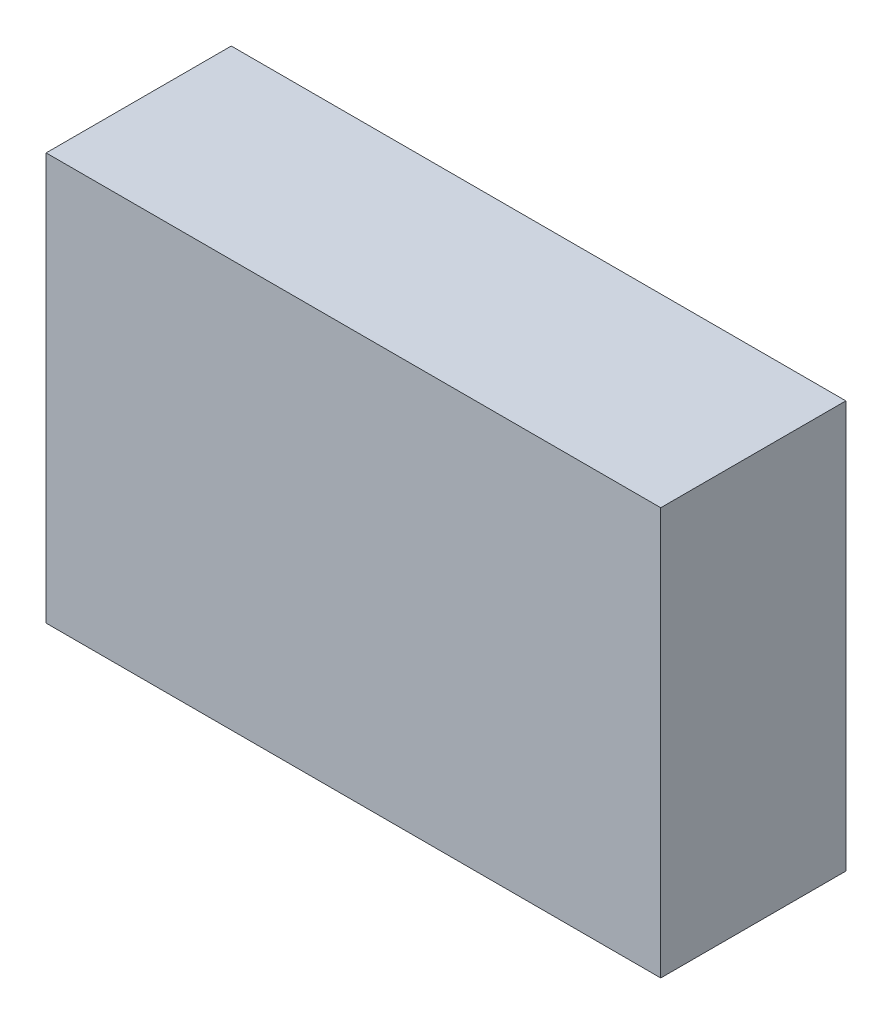
ISO-10303-21;
HEADER;
FILE_DESCRIPTION(('STEP AP214'),'2;1');
FILE_NAME('part.step','',(''),(''),'','','');
FILE_SCHEMA(('AUTOMOTIVE_DESIGN { 1 0 10303 214 1 1 1 1 }'));
ENDSEC;
DATA;
#1=APPLICATION_CONTEXT('core data for automotive mechanical design processes');
#2=APPLICATION_PROTOCOL_DEFINITION('international standard','automotive_design',2000,#1);
#3=PRODUCT_CONTEXT('',#1,'mechanical');
#4=PRODUCT('Part','Part','',(#3));
#5=PRODUCT_RELATED_PRODUCT_CATEGORY('part','',(#4));
#6=PRODUCT_DEFINITION_FORMATION('','',#4);
#7=PRODUCT_DEFINITION_CONTEXT('part definition',#1,'design');
#8=PRODUCT_DEFINITION('design','',#6,#7);
#9=PRODUCT_DEFINITION_SHAPE('','',#8);
#10=(LENGTH_UNIT() NAMED_UNIT(*) SI_UNIT(.MILLI.,.METRE.));
#11=(NAMED_UNIT(*) PLANE_ANGLE_UNIT() SI_UNIT($,.RADIAN.));
#12=(NAMED_UNIT(*) SI_UNIT($,.STERADIAN.) SOLID_ANGLE_UNIT());
#13=UNCERTAINTY_MEASURE_WITH_UNIT(LENGTH_MEASURE(1.E-05),#10,'distance_accuracy_value','');
#14=(GEOMETRIC_REPRESENTATION_CONTEXT(3) GLOBAL_UNCERTAINTY_ASSIGNED_CONTEXT((#13)) GLOBAL_UNIT_ASSIGNED_CONTEXT((#10,
#11,#12)) REPRESENTATION_CONTEXT('',''));
#15=CARTESIAN_POINT('',(0.,0.,0.));
#16=DIRECTION('',(0.,0.,1.));
#17=DIRECTION('',(1.,0.,0.));
#18=AXIS2_PLACEMENT_3D('',#15,#16,#17);
#19=CARTESIAN_POINT('',(0.,0.,50.));
#20=DIRECTION('',(1.,0.,0.));
#21=DIRECTION('',(0.,0.,-1.));
#22=AXIS2_PLACEMENT_3D('',#19,#20,#21);
#23=PLANE('',#22);
#24=DIRECTION('',(0.,-1.,0.));
#25=VECTOR('',#24,1.);
#26=CARTESIAN_POINT('',(0.,0.,0.));
#27=LINE('',#26,#25);
#28=CARTESIAN_POINT('',(0.,110.,0.));
#29=VERTEX_POINT('',#28);
#30=CARTESIAN_POINT('',(0.,0.,0.));
#31=VERTEX_POINT('',#30);
#32=EDGE_CURVE('E95',#29,#31,#27,.T.);
#33=ORIENTED_EDGE('',*,*,#32,.T.);
#34=DIRECTION('',(0.,0.,-1.));
#35=VECTOR('',#34,1.);
#36=CARTESIAN_POINT('',(0.,0.,50.));
#37=LINE('',#36,#35);
#38=CARTESIAN_POINT('',(0.,0.,50.));
#39=VERTEX_POINT('',#38);
#40=EDGE_CURVE('E11',#39,#31,#37,.T.);
#41=ORIENTED_EDGE('',*,*,#40,.F.);
#42=DIRECTION('',(0.,-1.,0.));
#43=VECTOR('',#42,1.);
#44=CARTESIAN_POINT('',(0.,0.,50.));
#45=LINE('',#44,#43);
#46=CARTESIAN_POINT('',(0.,110.,50.));
#47=VERTEX_POINT('',#46);
#48=EDGE_CURVE('E83',#47,#39,#45,.T.);
#49=ORIENTED_EDGE('',*,*,#48,.F.);
#50=DIRECTION('',(0.,0.,-1.));
#51=VECTOR('',#50,1.);
#52=CARTESIAN_POINT('',(0.,110.,50.));
#53=LINE('',#52,#51);
#54=EDGE_CURVE('E91',#47,#29,#53,.T.);
#55=ORIENTED_EDGE('',*,*,#54,.T.);
#56=EDGE_LOOP('',(#33,#41,#49,#55));
#57=FACE_BOUND('',#56,.T.);
#58=ADVANCED_FACE('F32',(#57),#23,.F.);
#59=CARTESIAN_POINT('',(0.,0.,50.));
#60=DIRECTION('',(0.,1.,0.));
#61=DIRECTION('',(0.,0.,1.));
#62=AXIS2_PLACEMENT_3D('',#59,#60,#61);
#63=PLANE('',#62);
#64=DIRECTION('',(1.,0.,0.));
#65=VECTOR('',#64,1.);
#66=CARTESIAN_POINT('',(0.,0.,0.));
#67=LINE('',#66,#65);
#68=CARTESIAN_POINT('',(166.,0.,0.));
#69=VERTEX_POINT('',#68);
#70=EDGE_CURVE('E87',#31,#69,#67,.T.);
#71=ORIENTED_EDGE('',*,*,#70,.T.);
#72=DIRECTION('',(0.,0.,-1.));
#73=VECTOR('',#72,1.);
#74=CARTESIAN_POINT('',(166.,0.,50.));
#75=LINE('',#74,#73);
#76=CARTESIAN_POINT('',(166.,0.,50.));
#77=VERTEX_POINT('',#76);
#78=EDGE_CURVE('E40',#77,#69,#75,.T.);
#79=ORIENTED_EDGE('',*,*,#78,.F.);
#80=DIRECTION('',(1.,0.,0.));
#81=VECTOR('',#80,1.);
#82=CARTESIAN_POINT('',(0.,0.,50.));
#83=LINE('',#82,#81);
#84=EDGE_CURVE('E78',#39,#77,#83,.T.);
#85=ORIENTED_EDGE('',*,*,#84,.F.);
#86=ORIENTED_EDGE('',*,*,#40,.T.);
#87=EDGE_LOOP('',(#71,#79,#85,#86));
#88=FACE_BOUND('',#87,.T.);
#89=ADVANCED_FACE('F86',(#88),#63,.F.);
#90=CARTESIAN_POINT('',(166.,0.,50.));
#91=DIRECTION('',(-1.,0.,0.));
#92=DIRECTION('',(0.,0.,1.));
#93=AXIS2_PLACEMENT_3D('',#90,#91,#92);
#94=PLANE('',#93);
#95=DIRECTION('',(0.,1.,0.));
#96=VECTOR('',#95,1.);
#97=CARTESIAN_POINT('',(166.,0.,0.));
#98=LINE('',#97,#96);
#99=CARTESIAN_POINT('',(166.,110.,0.));
#100=VERTEX_POINT('',#99);
#101=EDGE_CURVE('E65',#69,#100,#98,.T.);
#102=ORIENTED_EDGE('',*,*,#101,.T.);
#103=DIRECTION('',(0.,0.,-1.));
#104=VECTOR('',#103,1.);
#105=CARTESIAN_POINT('',(166.,110.,50.));
#106=LINE('',#105,#104);
#107=CARTESIAN_POINT('',(166.,110.,50.));
#108=VERTEX_POINT('',#107);
#109=EDGE_CURVE('E88',#108,#100,#106,.T.);
#110=ORIENTED_EDGE('',*,*,#109,.F.);
#111=DIRECTION('',(0.,1.,0.));
#112=VECTOR('',#111,1.);
#113=CARTESIAN_POINT('',(166.,0.,50.));
#114=LINE('',#113,#112);
#115=EDGE_CURVE('E81',#77,#108,#114,.T.);
#116=ORIENTED_EDGE('',*,*,#115,.F.);
#117=ORIENTED_EDGE('',*,*,#78,.T.);
#118=EDGE_LOOP('',(#102,#110,#116,#117));
#119=FACE_BOUND('',#118,.T.);
#120=ADVANCED_FACE('F89',(#119),#94,.F.);
#121=CARTESIAN_POINT('',(0.,110.,50.));
#122=DIRECTION('',(0.,-1.,0.));
#123=DIRECTION('',(0.,0.,-1.));
#124=AXIS2_PLACEMENT_3D('',#121,#122,#123);
#125=PLANE('',#124);
#126=DIRECTION('',(-1.,0.,0.));
#127=VECTOR('',#126,1.);
#128=CARTESIAN_POINT('',(0.,110.,0.));
#129=LINE('',#128,#127);
#130=EDGE_CURVE('E71',#100,#29,#129,.T.);
#131=ORIENTED_EDGE('',*,*,#130,.T.);
#132=ORIENTED_EDGE('',*,*,#54,.F.);
#133=DIRECTION('',(-1.,0.,0.));
#134=VECTOR('',#133,1.);
#135=CARTESIAN_POINT('',(0.,110.,50.));
#136=LINE('',#135,#134);
#137=EDGE_CURVE('E48',#108,#47,#136,.T.);
#138=ORIENTED_EDGE('',*,*,#137,.F.);
#139=ORIENTED_EDGE('',*,*,#109,.T.);
#140=EDGE_LOOP('',(#131,#132,#138,#139));
#141=FACE_BOUND('',#140,.T.);
#142=ADVANCED_FACE('F102',(#141),#125,.F.);
#143=CARTESIAN_POINT('',(0.,0.,50.));
#144=DIRECTION('',(0.,0.,-1.));
#145=DIRECTION('',(-1.,0.,0.));
#146=AXIS2_PLACEMENT_3D('',#143,#144,#145);
#147=PLANE('',#146);
#148=ORIENTED_EDGE('',*,*,#48,.T.);
#149=ORIENTED_EDGE('',*,*,#84,.T.);
#150=ORIENTED_EDGE('',*,*,#115,.T.);
#151=ORIENTED_EDGE('',*,*,#137,.T.);
#152=EDGE_LOOP('',(#148,#149,#150,#151));
#153=FACE_BOUND('',#152,.T.);
#154=ADVANCED_FACE('F79',(#153),#147,.F.);
#155=CARTESIAN_POINT('',(0.,0.,0.));
#156=DIRECTION('',(0.,0.,-1.));
#157=DIRECTION('',(-1.,0.,0.));
#158=AXIS2_PLACEMENT_3D('',#155,#156,#157);
#159=PLANE('',#158);
#160=ORIENTED_EDGE('',*,*,#32,.F.);
#161=ORIENTED_EDGE('',*,*,#130,.F.);
#162=ORIENTED_EDGE('',*,*,#101,.F.);
#163=ORIENTED_EDGE('',*,*,#70,.F.);
#164=EDGE_LOOP('',(#160,#161,#162,#163));
#165=FACE_BOUND('',#164,.T.);
#166=ADVANCED_FACE('F105',(#165),#159,.T.);
#167=CLOSED_SHELL('',(#58,#89,#120,#142,#154,#166));
#168=MANIFOLD_SOLID_BREP('B2',#167);
#169=ADVANCED_BREP_SHAPE_REPRESENTATION('',(#18,#168),#14);
#170=SHAPE_DEFINITION_REPRESENTATION(#9,#169);
ENDSEC;
END-ISO-10303-21;
